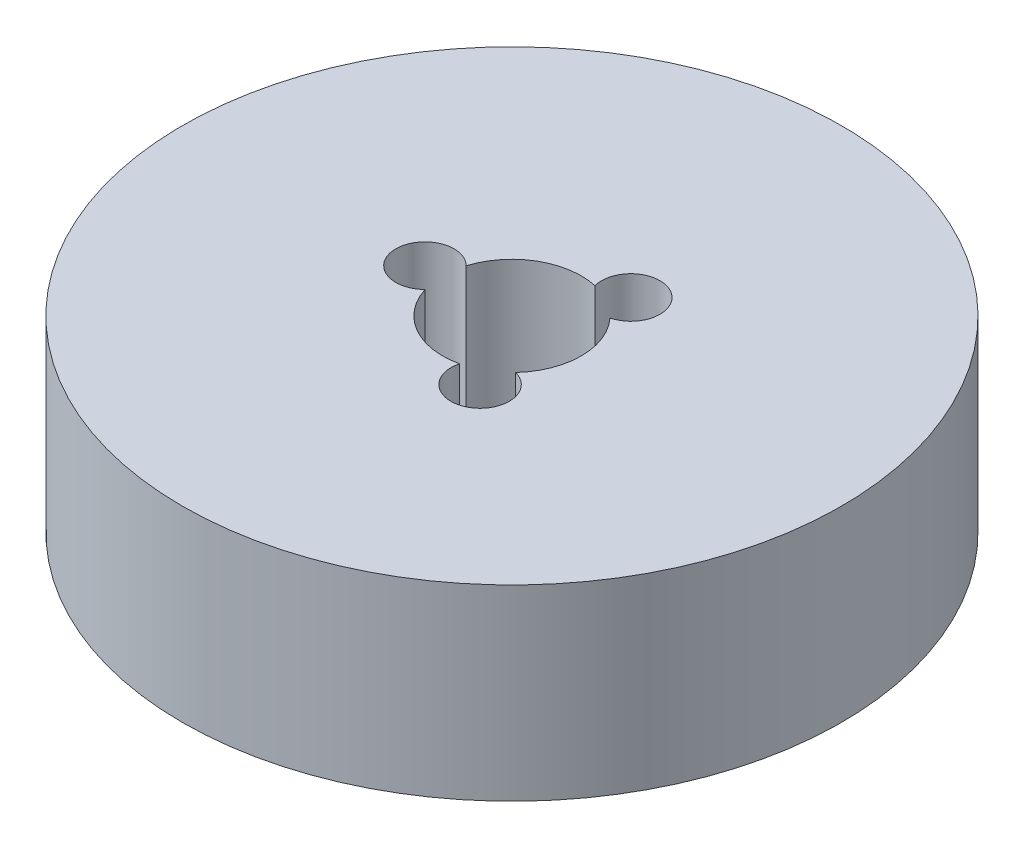
ISO-10303-21;
HEADER;
FILE_DESCRIPTION(('STEP AP214'),'2;1');
FILE_NAME('part.step','',(''),(''),'','','');
FILE_SCHEMA(('AUTOMOTIVE_DESIGN { 1 0 10303 214 1 1 1 1 }'));
ENDSEC;
DATA;
#1=APPLICATION_CONTEXT('core data for automotive mechanical design processes');
#2=APPLICATION_PROTOCOL_DEFINITION('international standard','automotive_design',2000,#1);
#3=PRODUCT_CONTEXT('',#1,'mechanical');
#4=PRODUCT('Part','Part','',(#3));
#5=PRODUCT_RELATED_PRODUCT_CATEGORY('part','',(#4));
#6=PRODUCT_DEFINITION_FORMATION('','',#4);
#7=PRODUCT_DEFINITION_CONTEXT('part definition',#1,'design');
#8=PRODUCT_DEFINITION('design','',#6,#7);
#9=PRODUCT_DEFINITION_SHAPE('','',#8);
#10=(LENGTH_UNIT() NAMED_UNIT(*) SI_UNIT(.MILLI.,.METRE.));
#11=(NAMED_UNIT(*) PLANE_ANGLE_UNIT() SI_UNIT($,.RADIAN.));
#12=(NAMED_UNIT(*) SI_UNIT($,.STERADIAN.) SOLID_ANGLE_UNIT());
#13=UNCERTAINTY_MEASURE_WITH_UNIT(LENGTH_MEASURE(1.E-05),#10,'distance_accuracy_value','');
#14=(GEOMETRIC_REPRESENTATION_CONTEXT(3) GLOBAL_UNCERTAINTY_ASSIGNED_CONTEXT((#13)) GLOBAL_UNIT_ASSIGNED_CONTEXT((#10,
#11,#12)) REPRESENTATION_CONTEXT('',''));
#15=CARTESIAN_POINT('',(0.,0.,0.));
#16=DIRECTION('',(0.,0.,1.));
#17=DIRECTION('',(1.,0.,0.));
#18=AXIS2_PLACEMENT_3D('',#15,#16,#17);
#19=CARTESIAN_POINT('',(0.,27.,0.));
#20=DIRECTION('',(0.,-1.,0.));
#21=DIRECTION('',(0.,0.,-1.));
#22=AXIS2_PLACEMENT_3D('',#19,#20,#21);
#23=CYLINDRICAL_SURFACE('',#22,47.5);
#24=CARTESIAN_POINT('',(0.,27.,0.));
#25=DIRECTION('',(0.,1.,0.));
#26=DIRECTION('',(0.,0.,1.));
#27=AXIS2_PLACEMENT_3D('',#24,#25,#26);
#28=CIRCLE('',#27,47.5);
#29=CARTESIAN_POINT('',(0.,27.,47.5));
#30=VERTEX_POINT('',#29);
#31=EDGE_CURVE('E126',#30,#30,#28,.T.);
#32=ORIENTED_EDGE('',*,*,#31,.F.);
#33=EDGE_LOOP('',(#32));
#34=FACE_BOUND('',#33,.T.);
#35=CARTESIAN_POINT('',(0.,0.,0.));
#36=DIRECTION('',(0.,1.,0.));
#37=DIRECTION('',(0.,0.,1.));
#38=AXIS2_PLACEMENT_3D('',#35,#36,#37);
#39=CIRCLE('',#38,47.5);
#40=CARTESIAN_POINT('',(0.,0.,47.5));
#41=VERTEX_POINT('',#40);
#42=EDGE_CURVE('E124',#41,#41,#39,.T.);
#43=ORIENTED_EDGE('',*,*,#42,.T.);
#44=EDGE_LOOP('',(#43));
#45=FACE_BOUND('',#44,.T.);
#46=ADVANCED_FACE('F39',(#34,#45),#23,.T.);
#47=CARTESIAN_POINT('',(0.,27.,0.));
#48=DIRECTION('',(0.,1.,0.));
#49=DIRECTION('',(0.,0.,1.));
#50=AXIS2_PLACEMENT_3D('',#47,#48,#49);
#51=PLANE('',#50);
#52=CARTESIAN_POINT('',(6.27050760004246,27.,10.8608377525202));
#53=DIRECTION('',(0.,1.,0.));
#54=DIRECTION('',(0.866025403784436,0.,-0.500000000000004));
#55=AXIS2_PLACEMENT_3D('',#52,#53,#54);
#56=CIRCLE('',#55,4.20393647759426);
#57=CARTESIAN_POINT('',(2.21558636486956,27.,9.75147050755957));
#58=VERTEX_POINT('',#57);
#59=CARTESIAN_POINT('',(7.33722800136661,27.,6.79448933003517));
#60=VERTEX_POINT('',#59);
#61=EDGE_CURVE('E147',#58,#60,#56,.T.);
#62=ORIENTED_EDGE('',*,*,#61,.F.);
#63=CARTESIAN_POINT('',(0.,27.,0.));
#64=DIRECTION('',(0.,1.,0.));
#65=DIRECTION('',(0.,0.,1.));
#66=AXIS2_PLACEMENT_3D('',#63,#64,#65);
#67=CIRCLE('',#66,10.);
#68=CARTESIAN_POINT('',(-9.55281436623609,27.,2.95698117752437));
#69=VERTEX_POINT('',#68);
#70=EDGE_CURVE('E118',#69,#58,#67,.T.);
#71=ORIENTED_EDGE('',*,*,#70,.F.);
#72=CARTESIAN_POINT('',(-12.5410152000848,27.,0.));
#73=DIRECTION('',(0.,1.,0.));
#74=DIRECTION('',(0.,0.,1.));
#75=AXIS2_PLACEMENT_3D('',#72,#73,#74);
#76=CIRCLE('',#75,4.20393647759426);
#77=CARTESIAN_POINT('',(-9.55281436623609,27.,-2.95698117752437));
#78=VERTEX_POINT('',#77);
#79=EDGE_CURVE('E113',#78,#69,#76,.T.);
#80=ORIENTED_EDGE('',*,*,#79,.F.);
#81=CARTESIAN_POINT('',(2.21558636486942,27.,-9.7514705075596));
#82=VERTEX_POINT('',#81);
#83=EDGE_CURVE('E106',#82,#78,#67,.T.);
#84=ORIENTED_EDGE('',*,*,#83,.F.);
#85=CARTESIAN_POINT('',(6.2705076000423,27.,-10.8608377525203));
#86=DIRECTION('',(0.,1.,0.));
#87=DIRECTION('',(-0.866025403784443,0.,-0.499999999999992));
#88=AXIS2_PLACEMENT_3D('',#85,#86,#87);
#89=CIRCLE('',#88,4.20393647759426);
#90=CARTESIAN_POINT('',(7.33722800136651,27.,-6.79448933003527));
#91=VERTEX_POINT('',#90);
#92=EDGE_CURVE('E90',#91,#82,#89,.T.);
#93=ORIENTED_EDGE('',*,*,#92,.F.);
#94=EDGE_CURVE('E116',#60,#91,#67,.T.);
#95=ORIENTED_EDGE('',*,*,#94,.F.);
#96=EDGE_LOOP('',(#62,#71,#80,#84,#93,#95));
#97=FACE_BOUND('',#96,.T.);
#98=ORIENTED_EDGE('',*,*,#31,.T.);
#99=EDGE_LOOP('',(#98));
#100=FACE_BOUND('',#99,.T.);
#101=ADVANCED_FACE('F115',(#97,#100),#51,.T.);
#102=CARTESIAN_POINT('',(0.,0.,0.));
#103=DIRECTION('',(0.,1.,0.));
#104=DIRECTION('',(0.,0.,1.));
#105=AXIS2_PLACEMENT_3D('',#102,#103,#104);
#106=PLANE('',#105);
#107=CARTESIAN_POINT('',(0.,0.,0.));
#108=DIRECTION('',(0.,1.,0.));
#109=DIRECTION('',(0.,0.,1.));
#110=AXIS2_PLACEMENT_3D('',#107,#108,#109);
#111=CIRCLE('',#110,10.);
#112=CARTESIAN_POINT('',(0.,0.,10.));
#113=VERTEX_POINT('',#112);
#114=EDGE_CURVE('E120',#113,#113,#111,.T.);
#115=ORIENTED_EDGE('',*,*,#114,.T.);
#116=EDGE_LOOP('',(#115));
#117=FACE_BOUND('',#116,.T.);
#118=ORIENTED_EDGE('',*,*,#42,.F.);
#119=EDGE_LOOP('',(#118));
#120=FACE_BOUND('',#119,.T.);
#121=ADVANCED_FACE('F164',(#117,#120),#106,.F.);
#122=CARTESIAN_POINT('',(0.,27.,0.));
#123=DIRECTION('',(0.,-1.,0.));
#124=DIRECTION('',(0.,0.,-1.));
#125=AXIS2_PLACEMENT_3D('',#122,#123,#124);
#126=CYLINDRICAL_SURFACE('',#125,10.);
#127=DIRECTION('',(0.,1.,0.));
#128=VECTOR('',#127,1.);
#129=CARTESIAN_POINT('',(2.21558636486956,16.6659719236944,9.75147050755957));
#130=LINE('',#129,#128);
#131=CARTESIAN_POINT('',(2.21558636486956,6.33194384738871,9.75147050755957));
#132=VERTEX_POINT('',#131);
#133=EDGE_CURVE('E11',#132,#58,#130,.T.);
#134=ORIENTED_EDGE('',*,*,#133,.F.);
#135=CARTESIAN_POINT('',(0.,6.33194384738871,0.));
#136=DIRECTION('',(0.,1.,0.));
#137=DIRECTION('',(0.,0.,1.));
#138=AXIS2_PLACEMENT_3D('',#135,#136,#137);
#139=CIRCLE('',#138,10.);
#140=CARTESIAN_POINT('',(7.33722800136661,6.33194384738871,6.79448933003517));
#141=VERTEX_POINT('',#140);
#142=EDGE_CURVE('E144',#132,#141,#139,.T.);
#143=ORIENTED_EDGE('',*,*,#142,.T.);
#144=DIRECTION('',(0.,1.,0.));
#145=VECTOR('',#144,1.);
#146=CARTESIAN_POINT('',(7.33722800136661,16.6659719236944,6.79448933003517));
#147=LINE('',#146,#145);
#148=EDGE_CURVE('E46',#60,#141,#147,.F.);
#149=ORIENTED_EDGE('',*,*,#148,.F.);
#150=ORIENTED_EDGE('',*,*,#94,.T.);
#151=DIRECTION('',(0.,1.,0.));
#152=VECTOR('',#151,1.);
#153=CARTESIAN_POINT('',(7.33722800136651,16.6659719236944,-6.79448933003527));
#154=LINE('',#153,#152);
#155=CARTESIAN_POINT('',(7.33722800136651,6.33194384738871,-6.79448933003527));
#156=VERTEX_POINT('',#155);
#157=EDGE_CURVE('E92',#156,#91,#154,.T.);
#158=ORIENTED_EDGE('',*,*,#157,.F.);
#159=CARTESIAN_POINT('',(0.,6.33194384738871,0.));
#160=DIRECTION('',(0.,1.,0.));
#161=DIRECTION('',(0.,0.,1.));
#162=AXIS2_PLACEMENT_3D('',#159,#160,#161);
#163=CIRCLE('',#162,10.);
#164=CARTESIAN_POINT('',(2.21558636486942,6.33194384738871,-9.7514705075596));
#165=VERTEX_POINT('',#164);
#166=EDGE_CURVE('E107',#156,#165,#163,.T.);
#167=ORIENTED_EDGE('',*,*,#166,.T.);
#168=DIRECTION('',(0.,1.,0.));
#169=VECTOR('',#168,1.);
#170=CARTESIAN_POINT('',(2.21558636486942,16.6659719236944,-9.7514705075596));
#171=LINE('',#170,#169);
#172=EDGE_CURVE('E95',#82,#165,#171,.F.);
#173=ORIENTED_EDGE('',*,*,#172,.F.);
#174=ORIENTED_EDGE('',*,*,#83,.T.);
#175=DIRECTION('',(0.,1.,0.));
#176=VECTOR('',#175,1.);
#177=CARTESIAN_POINT('',(-9.55281436623609,16.6659719236944,-2.95698117752437));
#178=LINE('',#177,#176);
#179=CARTESIAN_POINT('',(-9.55281436623609,6.33194384738871,-2.95698117752437));
#180=VERTEX_POINT('',#179);
#181=EDGE_CURVE('E143',#180,#78,#178,.T.);
#182=ORIENTED_EDGE('',*,*,#181,.F.);
#183=CARTESIAN_POINT('',(0.,6.33194384738871,0.));
#184=DIRECTION('',(0.,1.,0.));
#185=DIRECTION('',(0.,0.,1.));
#186=AXIS2_PLACEMENT_3D('',#183,#184,#185);
#187=CIRCLE('',#186,10.);
#188=CARTESIAN_POINT('',(-9.55281436623609,6.33194384738871,2.95698117752437));
#189=VERTEX_POINT('',#188);
#190=EDGE_CURVE('E132',#180,#189,#187,.T.);
#191=ORIENTED_EDGE('',*,*,#190,.T.);
#192=DIRECTION('',(0.,1.,0.));
#193=VECTOR('',#192,1.);
#194=CARTESIAN_POINT('',(-9.55281436623609,16.6659719236944,2.95698117752437));
#195=LINE('',#194,#193);
#196=EDGE_CURVE('E137',#69,#189,#195,.F.);
#197=ORIENTED_EDGE('',*,*,#196,.F.);
#198=ORIENTED_EDGE('',*,*,#70,.T.);
#199=EDGE_LOOP('',(#134,#143,#149,#150,#158,#167,#173,#174,#182,#191,#197,#198));
#200=FACE_BOUND('',#199,.T.);
#201=ORIENTED_EDGE('',*,*,#114,.F.);
#202=EDGE_LOOP('',(#201));
#203=FACE_BOUND('',#202,.T.);
#204=ADVANCED_FACE('F103',(#200,#203),#126,.F.);
#205=CARTESIAN_POINT('',(-12.5410152000848,6.33194384738871,0.));
#206=DIRECTION('',(0.,1.,0.));
#207=DIRECTION('',(0.,0.,1.));
#208=AXIS2_PLACEMENT_3D('',#205,#206,#207);
#209=CYLINDRICAL_SURFACE('',#208,4.20393647759426);
#210=ORIENTED_EDGE('',*,*,#181,.T.);
#211=ORIENTED_EDGE('',*,*,#79,.T.);
#212=ORIENTED_EDGE('',*,*,#196,.T.);
#213=CARTESIAN_POINT('',(-12.5410152000848,6.33194384738871,0.));
#214=DIRECTION('',(0.,1.,0.));
#215=DIRECTION('',(0.,0.,1.));
#216=AXIS2_PLACEMENT_3D('',#213,#214,#215);
#217=CIRCLE('',#216,4.20393647759426);
#218=EDGE_CURVE('E121',#180,#189,#217,.T.);
#219=ORIENTED_EDGE('',*,*,#218,.F.);
#220=EDGE_LOOP('',(#210,#211,#212,#219));
#221=FACE_BOUND('',#220,.T.);
#222=ADVANCED_FACE('F174',(#221),#209,.F.);
#223=CARTESIAN_POINT('',(-12.5410152000848,6.33194384738871,0.));
#224=DIRECTION('',(0.,1.,0.));
#225=DIRECTION('',(0.,0.,1.));
#226=AXIS2_PLACEMENT_3D('',#223,#224,#225);
#227=PLANE('',#226);
#228=ORIENTED_EDGE('',*,*,#218,.T.);
#229=ORIENTED_EDGE('',*,*,#190,.F.);
#230=EDGE_LOOP('',(#228,#229));
#231=FACE_BOUND('',#230,.T.);
#232=ADVANCED_FACE('F177',(#231),#227,.T.);
#233=CARTESIAN_POINT('',(6.2705076000423,6.33194384738871,-10.8608377525203));
#234=DIRECTION('',(0.,1.,0.));
#235=DIRECTION('',(0.,0.,1.));
#236=AXIS2_PLACEMENT_3D('',#233,#234,#235);
#237=CYLINDRICAL_SURFACE('',#236,4.20393647759426);
#238=ORIENTED_EDGE('',*,*,#157,.T.);
#239=ORIENTED_EDGE('',*,*,#92,.T.);
#240=ORIENTED_EDGE('',*,*,#172,.T.);
#241=CARTESIAN_POINT('',(6.2705076000423,6.33194384738871,-10.8608377525203));
#242=DIRECTION('',(0.,1.,0.));
#243=DIRECTION('',(-0.866025403784443,0.,-0.499999999999992));
#244=AXIS2_PLACEMENT_3D('',#241,#242,#243);
#245=CIRCLE('',#244,4.20393647759426);
#246=EDGE_CURVE('E56',#156,#165,#245,.T.);
#247=ORIENTED_EDGE('',*,*,#246,.F.);
#248=EDGE_LOOP('',(#238,#239,#240,#247));
#249=FACE_BOUND('',#248,.T.);
#250=ADVANCED_FACE('F93',(#249),#237,.F.);
#251=CARTESIAN_POINT('',(6.2705076000423,6.33194384738871,-10.8608377525203));
#252=DIRECTION('',(0.,1.,0.));
#253=DIRECTION('',(-0.866025403784443,0.,-0.499999999999992));
#254=AXIS2_PLACEMENT_3D('',#251,#252,#253);
#255=PLANE('',#254);
#256=ORIENTED_EDGE('',*,*,#246,.T.);
#257=ORIENTED_EDGE('',*,*,#166,.F.);
#258=EDGE_LOOP('',(#256,#257));
#259=FACE_BOUND('',#258,.T.);
#260=ADVANCED_FACE('F160',(#259),#255,.T.);
#261=CARTESIAN_POINT('',(6.27050760004246,6.33194384738871,10.8608377525202));
#262=DIRECTION('',(0.,1.,0.));
#263=DIRECTION('',(0.,0.,1.));
#264=AXIS2_PLACEMENT_3D('',#261,#262,#263);
#265=CYLINDRICAL_SURFACE('',#264,4.20393647759426);
#266=ORIENTED_EDGE('',*,*,#133,.T.);
#267=ORIENTED_EDGE('',*,*,#61,.T.);
#268=ORIENTED_EDGE('',*,*,#148,.T.);
#269=CARTESIAN_POINT('',(6.27050760004246,6.33194384738871,10.8608377525202));
#270=DIRECTION('',(0.,1.,0.));
#271=DIRECTION('',(0.866025403784436,0.,-0.500000000000004));
#272=AXIS2_PLACEMENT_3D('',#269,#270,#271);
#273=CIRCLE('',#272,4.20393647759426);
#274=EDGE_CURVE('E55',#132,#141,#273,.T.);
#275=ORIENTED_EDGE('',*,*,#274,.F.);
#276=EDGE_LOOP('',(#266,#267,#268,#275));
#277=FACE_BOUND('',#276,.T.);
#278=ADVANCED_FACE('F149',(#277),#265,.F.);
#279=CARTESIAN_POINT('',(6.27050760004246,6.33194384738871,10.8608377525202));
#280=DIRECTION('',(0.,1.,0.));
#281=DIRECTION('',(0.866025403784436,0.,-0.500000000000004));
#282=AXIS2_PLACEMENT_3D('',#279,#280,#281);
#283=PLANE('',#282);
#284=ORIENTED_EDGE('',*,*,#274,.T.);
#285=ORIENTED_EDGE('',*,*,#142,.F.);
#286=EDGE_LOOP('',(#284,#285));
#287=FACE_BOUND('',#286,.T.);
#288=ADVANCED_FACE('F151',(#287),#283,.T.);
#289=CLOSED_SHELL('',(#46,#101,#121,#204,#222,#232,#250,#260,#278,#288));
#290=MANIFOLD_SOLID_BREP('B2',#289);
#291=ADVANCED_BREP_SHAPE_REPRESENTATION('',(#18,#290),#14);
#292=SHAPE_DEFINITION_REPRESENTATION(#9,#291);
ENDSEC;
END-ISO-10303-21;
